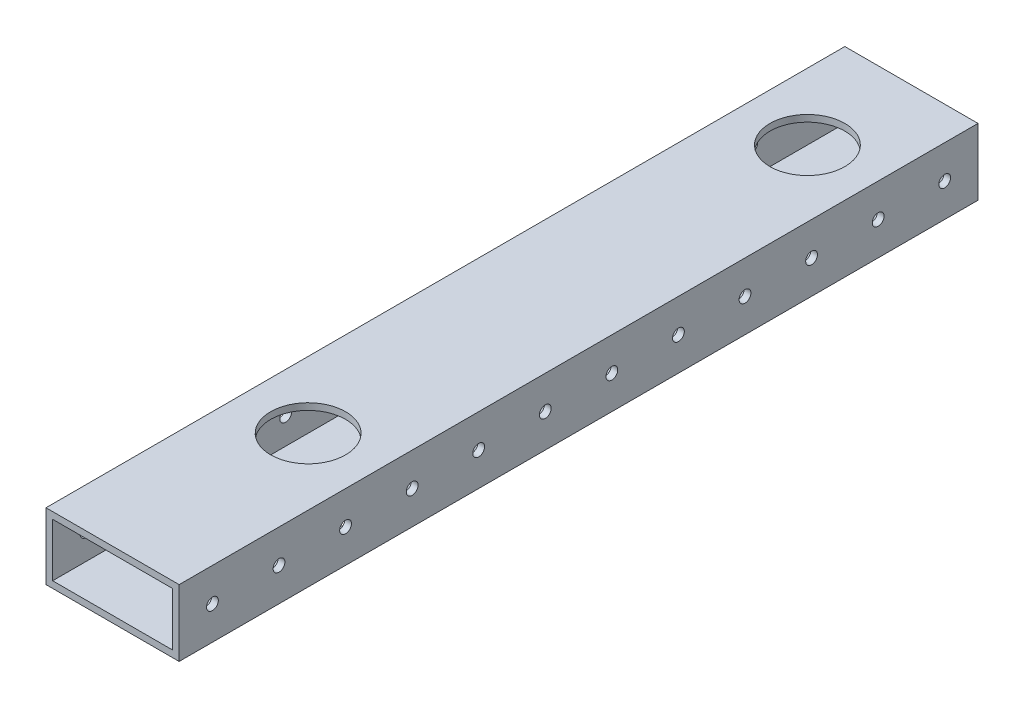
ISO-10303-21;
HEADER;
FILE_DESCRIPTION(('STEP AP214'),'2;1');
FILE_NAME('part.step','',(''),(''),'','','');
FILE_SCHEMA(('AUTOMOTIVE_DESIGN { 1 0 10303 214 1 1 1 1 }'));
ENDSEC;
DATA;
#1=APPLICATION_CONTEXT('core data for automotive mechanical design processes');
#2=APPLICATION_PROTOCOL_DEFINITION('international standard','automotive_design',2000,#1);
#3=PRODUCT_CONTEXT('',#1,'mechanical');
#4=PRODUCT('Part','Part','',(#3));
#5=PRODUCT_RELATED_PRODUCT_CATEGORY('part','',(#4));
#6=PRODUCT_DEFINITION_FORMATION('','',#4);
#7=PRODUCT_DEFINITION_CONTEXT('part definition',#1,'design');
#8=PRODUCT_DEFINITION('design','',#6,#7);
#9=PRODUCT_DEFINITION_SHAPE('','',#8);
#10=(LENGTH_UNIT() NAMED_UNIT(*) SI_UNIT(.MILLI.,.METRE.));
#11=(NAMED_UNIT(*) PLANE_ANGLE_UNIT() SI_UNIT($,.RADIAN.));
#12=(NAMED_UNIT(*) SI_UNIT($,.STERADIAN.) SOLID_ANGLE_UNIT());
#13=UNCERTAINTY_MEASURE_WITH_UNIT(LENGTH_MEASURE(1.E-05),#10,'distance_accuracy_value','');
#14=(GEOMETRIC_REPRESENTATION_CONTEXT(3) GLOBAL_UNCERTAINTY_ASSIGNED_CONTEXT((#13)) GLOBAL_UNIT_ASSIGNED_CONTEXT((#10,
#11,#12)) REPRESENTATION_CONTEXT('',''));
#15=CARTESIAN_POINT('',(0.,0.,0.));
#16=DIRECTION('',(0.,0.,1.));
#17=DIRECTION('',(1.,0.,0.));
#18=AXIS2_PLACEMENT_3D('',#15,#16,#17);
#19=CARTESIAN_POINT('',(-25.4,-12.7,-533.4));
#20=DIRECTION('',(-1.,0.,0.));
#21=DIRECTION('',(0.,0.,1.));
#22=AXIS2_PLACEMENT_3D('',#19,#20,#21);
#23=PLANE('',#22);
#24=DIRECTION('',(0.,-1.,0.));
#25=VECTOR('',#24,1.);
#26=CARTESIAN_POINT('',(-25.4,-12.7,-228.6));
#27=LINE('',#26,#25);
#28=CARTESIAN_POINT('',(-25.4,12.7,-228.6));
#29=VERTEX_POINT('',#28);
#30=CARTESIAN_POINT('',(-25.4,-12.7,-228.6));
#31=VERTEX_POINT('',#30);
#32=EDGE_CURVE('E105',#29,#31,#27,.T.);
#33=ORIENTED_EDGE('',*,*,#32,.F.);
#34=DIRECTION('',(0.,0.,1.));
#35=VECTOR('',#34,1.);
#36=CARTESIAN_POINT('',(-25.4,12.7,-533.4));
#37=LINE('',#36,#35);
#38=CARTESIAN_POINT('',(-25.4,12.7,-533.4));
#39=VERTEX_POINT('',#38);
#40=EDGE_CURVE('E117',#39,#29,#37,.T.);
#41=ORIENTED_EDGE('',*,*,#40,.F.);
#42=DIRECTION('',(0.,-1.,0.));
#43=VECTOR('',#42,1.);
#44=CARTESIAN_POINT('',(-25.4,-12.7,-533.4));
#45=LINE('',#44,#43);
#46=CARTESIAN_POINT('',(-25.4,-12.7,-533.4));
#47=VERTEX_POINT('',#46);
#48=EDGE_CURVE('E411',#39,#47,#45,.T.);
#49=ORIENTED_EDGE('',*,*,#48,.T.);
#50=DIRECTION('',(0.,0.,1.));
#51=VECTOR('',#50,1.);
#52=CARTESIAN_POINT('',(-25.4,-12.7,-533.4));
#53=LINE('',#52,#51);
#54=EDGE_CURVE('E119',#47,#31,#53,.T.);
#55=ORIENTED_EDGE('',*,*,#54,.T.);
#56=EDGE_LOOP('',(#33,#41,#49,#55));
#57=FACE_BOUND('',#56,.T.);
#58=CARTESIAN_POINT('',(-25.4,0.,-241.3));
#59=DIRECTION('',(1.,0.,0.));
#60=DIRECTION('',(0.,0.,-1.));
#61=AXIS2_PLACEMENT_3D('',#58,#59,#60);
#62=CIRCLE('',#61,2.24789999999999);
#63=CARTESIAN_POINT('',(-25.4,0.,-243.5479));
#64=VERTEX_POINT('',#63);
#65=EDGE_CURVE('E201',#64,#64,#62,.T.);
#66=ORIENTED_EDGE('',*,*,#65,.T.);
#67=EDGE_LOOP('',(#66));
#68=FACE_BOUND('',#67,.T.);
#69=CARTESIAN_POINT('',(-25.4,0.,-266.7));
#70=DIRECTION('',(1.,0.,0.));
#71=DIRECTION('',(0.,0.,-1.));
#72=AXIS2_PLACEMENT_3D('',#69,#70,#71);
#73=CIRCLE('',#72,2.24789999999999);
#74=CARTESIAN_POINT('',(-25.4,0.,-268.9479));
#75=VERTEX_POINT('',#74);
#76=EDGE_CURVE('E196',#75,#75,#73,.T.);
#77=ORIENTED_EDGE('',*,*,#76,.T.);
#78=EDGE_LOOP('',(#77));
#79=FACE_BOUND('',#78,.T.);
#80=CARTESIAN_POINT('',(-25.4,0.,-292.1));
#81=DIRECTION('',(1.,0.,0.));
#82=DIRECTION('',(0.,0.,-1.));
#83=AXIS2_PLACEMENT_3D('',#80,#81,#82);
#84=CIRCLE('',#83,2.24789999999999);
#85=CARTESIAN_POINT('',(-25.4,0.,-294.3479));
#86=VERTEX_POINT('',#85);
#87=EDGE_CURVE('E190',#86,#86,#84,.T.);
#88=ORIENTED_EDGE('',*,*,#87,.T.);
#89=EDGE_LOOP('',(#88));
#90=FACE_BOUND('',#89,.T.);
#91=CARTESIAN_POINT('',(-25.4,0.,-317.5));
#92=DIRECTION('',(1.,0.,0.));
#93=DIRECTION('',(0.,0.,-1.));
#94=AXIS2_PLACEMENT_3D('',#91,#92,#93);
#95=CIRCLE('',#94,2.24789999999999);
#96=CARTESIAN_POINT('',(-25.4,0.,-319.7479));
#97=VERTEX_POINT('',#96);
#98=EDGE_CURVE('E184',#97,#97,#95,.T.);
#99=ORIENTED_EDGE('',*,*,#98,.T.);
#100=EDGE_LOOP('',(#99));
#101=FACE_BOUND('',#100,.T.);
#102=CARTESIAN_POINT('',(-25.4,0.,-342.9));
#103=DIRECTION('',(1.,0.,0.));
#104=DIRECTION('',(0.,0.,-1.));
#105=AXIS2_PLACEMENT_3D('',#102,#103,#104);
#106=CIRCLE('',#105,2.24789999999999);
#107=CARTESIAN_POINT('',(-25.4,0.,-345.1479));
#108=VERTEX_POINT('',#107);
#109=EDGE_CURVE('E178',#108,#108,#106,.T.);
#110=ORIENTED_EDGE('',*,*,#109,.T.);
#111=EDGE_LOOP('',(#110));
#112=FACE_BOUND('',#111,.T.);
#113=CARTESIAN_POINT('',(-25.4,0.,-368.3));
#114=DIRECTION('',(1.,0.,0.));
#115=DIRECTION('',(0.,0.,-1.));
#116=AXIS2_PLACEMENT_3D('',#113,#114,#115);
#117=CIRCLE('',#116,2.24789999999999);
#118=CARTESIAN_POINT('',(-25.4,0.,-370.5479));
#119=VERTEX_POINT('',#118);
#120=EDGE_CURVE('E172',#119,#119,#117,.T.);
#121=ORIENTED_EDGE('',*,*,#120,.T.);
#122=EDGE_LOOP('',(#121));
#123=FACE_BOUND('',#122,.T.);
#124=CARTESIAN_POINT('',(-25.4,0.,-393.7));
#125=DIRECTION('',(1.,0.,0.));
#126=DIRECTION('',(0.,0.,-1.));
#127=AXIS2_PLACEMENT_3D('',#124,#125,#126);
#128=CIRCLE('',#127,2.24789999999999);
#129=CARTESIAN_POINT('',(-25.4,0.,-395.9479));
#130=VERTEX_POINT('',#129);
#131=EDGE_CURVE('E166',#130,#130,#128,.T.);
#132=ORIENTED_EDGE('',*,*,#131,.T.);
#133=EDGE_LOOP('',(#132));
#134=FACE_BOUND('',#133,.T.);
#135=CARTESIAN_POINT('',(-25.4,0.,-419.1));
#136=DIRECTION('',(1.,0.,0.));
#137=DIRECTION('',(0.,0.,-1.));
#138=AXIS2_PLACEMENT_3D('',#135,#136,#137);
#139=CIRCLE('',#138,2.24789999999999);
#140=CARTESIAN_POINT('',(-25.4,0.,-421.3479));
#141=VERTEX_POINT('',#140);
#142=EDGE_CURVE('E160',#141,#141,#139,.T.);
#143=ORIENTED_EDGE('',*,*,#142,.T.);
#144=EDGE_LOOP('',(#143));
#145=FACE_BOUND('',#144,.T.);
#146=CARTESIAN_POINT('',(-25.4,0.,-444.5));
#147=DIRECTION('',(1.,0.,0.));
#148=DIRECTION('',(0.,0.,-1.));
#149=AXIS2_PLACEMENT_3D('',#146,#147,#148);
#150=CIRCLE('',#149,2.24789999999999);
#151=CARTESIAN_POINT('',(-25.4,0.,-446.7479));
#152=VERTEX_POINT('',#151);
#153=EDGE_CURVE('E154',#152,#152,#150,.T.);
#154=ORIENTED_EDGE('',*,*,#153,.T.);
#155=EDGE_LOOP('',(#154));
#156=FACE_BOUND('',#155,.T.);
#157=CARTESIAN_POINT('',(-25.4,0.,-469.9));
#158=DIRECTION('',(1.,0.,0.));
#159=DIRECTION('',(0.,0.,-1.));
#160=AXIS2_PLACEMENT_3D('',#157,#158,#159);
#161=CIRCLE('',#160,2.24789999999999);
#162=CARTESIAN_POINT('',(-25.4,0.,-472.1479));
#163=VERTEX_POINT('',#162);
#164=EDGE_CURVE('E148',#163,#163,#161,.T.);
#165=ORIENTED_EDGE('',*,*,#164,.T.);
#166=EDGE_LOOP('',(#165));
#167=FACE_BOUND('',#166,.T.);
#168=CARTESIAN_POINT('',(-25.4,0.,-495.3));
#169=DIRECTION('',(1.,0.,0.));
#170=DIRECTION('',(0.,0.,-1.));
#171=AXIS2_PLACEMENT_3D('',#168,#169,#170);
#172=CIRCLE('',#171,2.24789999999999);
#173=CARTESIAN_POINT('',(-25.4,0.,-497.5479));
#174=VERTEX_POINT('',#173);
#175=EDGE_CURVE('E142',#174,#174,#172,.T.);
#176=ORIENTED_EDGE('',*,*,#175,.T.);
#177=EDGE_LOOP('',(#176));
#178=FACE_BOUND('',#177,.T.);
#179=CARTESIAN_POINT('',(-25.4,0.,-520.7));
#180=DIRECTION('',(1.,0.,0.));
#181=DIRECTION('',(0.,0.,-1.));
#182=AXIS2_PLACEMENT_3D('',#179,#180,#181);
#183=CIRCLE('',#182,2.24789999999999);
#184=CARTESIAN_POINT('',(-25.4,0.,-522.9479));
#185=VERTEX_POINT('',#184);
#186=EDGE_CURVE('E361',#185,#185,#183,.T.);
#187=ORIENTED_EDGE('',*,*,#186,.T.);
#188=EDGE_LOOP('',(#187));
#189=FACE_BOUND('',#188,.T.);
#190=ADVANCED_FACE('F38',(#57,#68,#79,#90,#101,#112,#123,#134,#145,#156,#167,#178,#189),#23,.T.);
#191=CARTESIAN_POINT('',(25.4,-12.7,-533.4));
#192=DIRECTION('',(1.,0.,0.));
#193=DIRECTION('',(0.,0.,-1.));
#194=AXIS2_PLACEMENT_3D('',#191,#192,#193);
#195=PLANE('',#194);
#196=DIRECTION('',(0.,1.,0.));
#197=VECTOR('',#196,1.);
#198=CARTESIAN_POINT('',(25.4,-12.7,-228.6));
#199=LINE('',#198,#197);
#200=CARTESIAN_POINT('',(25.4,-12.7,-228.6));
#201=VERTEX_POINT('',#200);
#202=CARTESIAN_POINT('',(25.4,12.7,-228.6));
#203=VERTEX_POINT('',#202);
#204=EDGE_CURVE('E56',#201,#203,#199,.T.);
#205=ORIENTED_EDGE('',*,*,#204,.F.);
#206=DIRECTION('',(0.,0.,1.));
#207=VECTOR('',#206,1.);
#208=CARTESIAN_POINT('',(25.4,-12.7,-533.4));
#209=LINE('',#208,#207);
#210=CARTESIAN_POINT('',(25.4,-12.7,-533.4));
#211=VERTEX_POINT('',#210);
#212=EDGE_CURVE('E48',#211,#201,#209,.T.);
#213=ORIENTED_EDGE('',*,*,#212,.F.);
#214=DIRECTION('',(0.,1.,0.));
#215=VECTOR('',#214,1.);
#216=CARTESIAN_POINT('',(25.4,-12.7,-533.4));
#217=LINE('',#216,#215);
#218=CARTESIAN_POINT('',(25.4,12.7,-533.4));
#219=VERTEX_POINT('',#218);
#220=EDGE_CURVE('E394',#211,#219,#217,.T.);
#221=ORIENTED_EDGE('',*,*,#220,.T.);
#222=DIRECTION('',(0.,0.,1.));
#223=VECTOR('',#222,1.);
#224=CARTESIAN_POINT('',(25.4,12.7,-533.4));
#225=LINE('',#224,#223);
#226=EDGE_CURVE('E128',#219,#203,#225,.T.);
#227=ORIENTED_EDGE('',*,*,#226,.T.);
#228=EDGE_LOOP('',(#205,#213,#221,#227));
#229=FACE_BOUND('',#228,.T.);
#230=CARTESIAN_POINT('',(25.4,0.,-241.3));
#231=DIRECTION('',(1.,0.,0.));
#232=DIRECTION('',(0.,0.,-1.));
#233=AXIS2_PLACEMENT_3D('',#230,#231,#232);
#234=CIRCLE('',#233,2.24789999999999);
#235=CARTESIAN_POINT('',(25.4,0.,-243.5479));
#236=VERTEX_POINT('',#235);
#237=EDGE_CURVE('E121',#236,#236,#234,.T.);
#238=ORIENTED_EDGE('',*,*,#237,.F.);
#239=EDGE_LOOP('',(#238));
#240=FACE_BOUND('',#239,.T.);
#241=CARTESIAN_POINT('',(25.4,0.,-266.7));
#242=DIRECTION('',(1.,0.,0.));
#243=DIRECTION('',(0.,0.,-1.));
#244=AXIS2_PLACEMENT_3D('',#241,#242,#243);
#245=CIRCLE('',#244,2.24789999999999);
#246=CARTESIAN_POINT('',(25.4,0.,-268.9479));
#247=VERTEX_POINT('',#246);
#248=EDGE_CURVE('E257',#247,#247,#245,.T.);
#249=ORIENTED_EDGE('',*,*,#248,.F.);
#250=EDGE_LOOP('',(#249));
#251=FACE_BOUND('',#250,.T.);
#252=CARTESIAN_POINT('',(25.4,0.,-292.1));
#253=DIRECTION('',(1.,0.,0.));
#254=DIRECTION('',(0.,0.,-1.));
#255=AXIS2_PLACEMENT_3D('',#252,#253,#254);
#256=CIRCLE('',#255,2.24789999999999);
#257=CARTESIAN_POINT('',(25.4,0.,-294.3479));
#258=VERTEX_POINT('',#257);
#259=EDGE_CURVE('E267',#258,#258,#256,.T.);
#260=ORIENTED_EDGE('',*,*,#259,.F.);
#261=EDGE_LOOP('',(#260));
#262=FACE_BOUND('',#261,.T.);
#263=CARTESIAN_POINT('',(25.4,0.,-317.5));
#264=DIRECTION('',(1.,0.,0.));
#265=DIRECTION('',(0.,0.,-1.));
#266=AXIS2_PLACEMENT_3D('',#263,#264,#265);
#267=CIRCLE('',#266,2.24789999999999);
#268=CARTESIAN_POINT('',(25.4,0.,-319.7479));
#269=VERTEX_POINT('',#268);
#270=EDGE_CURVE('E277',#269,#269,#267,.T.);
#271=ORIENTED_EDGE('',*,*,#270,.F.);
#272=EDGE_LOOP('',(#271));
#273=FACE_BOUND('',#272,.T.);
#274=CARTESIAN_POINT('',(25.4,0.,-342.9));
#275=DIRECTION('',(1.,0.,0.));
#276=DIRECTION('',(0.,0.,-1.));
#277=AXIS2_PLACEMENT_3D('',#274,#275,#276);
#278=CIRCLE('',#277,2.24789999999999);
#279=CARTESIAN_POINT('',(25.4,0.,-345.1479));
#280=VERTEX_POINT('',#279);
#281=EDGE_CURVE('E287',#280,#280,#278,.T.);
#282=ORIENTED_EDGE('',*,*,#281,.F.);
#283=EDGE_LOOP('',(#282));
#284=FACE_BOUND('',#283,.T.);
#285=CARTESIAN_POINT('',(25.4,0.,-368.3));
#286=DIRECTION('',(1.,0.,0.));
#287=DIRECTION('',(0.,0.,-1.));
#288=AXIS2_PLACEMENT_3D('',#285,#286,#287);
#289=CIRCLE('',#288,2.24789999999999);
#290=CARTESIAN_POINT('',(25.4,0.,-370.5479));
#291=VERTEX_POINT('',#290);
#292=EDGE_CURVE('E297',#291,#291,#289,.T.);
#293=ORIENTED_EDGE('',*,*,#292,.F.);
#294=EDGE_LOOP('',(#293));
#295=FACE_BOUND('',#294,.T.);
#296=CARTESIAN_POINT('',(25.4,0.,-393.7));
#297=DIRECTION('',(1.,0.,0.));
#298=DIRECTION('',(0.,0.,-1.));
#299=AXIS2_PLACEMENT_3D('',#296,#297,#298);
#300=CIRCLE('',#299,2.24789999999999);
#301=CARTESIAN_POINT('',(25.4,0.,-395.9479));
#302=VERTEX_POINT('',#301);
#303=EDGE_CURVE('E307',#302,#302,#300,.T.);
#304=ORIENTED_EDGE('',*,*,#303,.F.);
#305=EDGE_LOOP('',(#304));
#306=FACE_BOUND('',#305,.T.);
#307=CARTESIAN_POINT('',(25.4,0.,-419.1));
#308=DIRECTION('',(1.,0.,0.));
#309=DIRECTION('',(0.,0.,-1.));
#310=AXIS2_PLACEMENT_3D('',#307,#308,#309);
#311=CIRCLE('',#310,2.24789999999999);
#312=CARTESIAN_POINT('',(25.4,0.,-421.3479));
#313=VERTEX_POINT('',#312);
#314=EDGE_CURVE('E317',#313,#313,#311,.T.);
#315=ORIENTED_EDGE('',*,*,#314,.F.);
#316=EDGE_LOOP('',(#315));
#317=FACE_BOUND('',#316,.T.);
#318=CARTESIAN_POINT('',(25.4,0.,-444.5));
#319=DIRECTION('',(1.,0.,0.));
#320=DIRECTION('',(0.,0.,-1.));
#321=AXIS2_PLACEMENT_3D('',#318,#319,#320);
#322=CIRCLE('',#321,2.24789999999999);
#323=CARTESIAN_POINT('',(25.4,0.,-446.7479));
#324=VERTEX_POINT('',#323);
#325=EDGE_CURVE('E327',#324,#324,#322,.T.);
#326=ORIENTED_EDGE('',*,*,#325,.F.);
#327=EDGE_LOOP('',(#326));
#328=FACE_BOUND('',#327,.T.);
#329=CARTESIAN_POINT('',(25.4,0.,-469.9));
#330=DIRECTION('',(1.,0.,0.));
#331=DIRECTION('',(0.,0.,-1.));
#332=AXIS2_PLACEMENT_3D('',#329,#330,#331);
#333=CIRCLE('',#332,2.24789999999999);
#334=CARTESIAN_POINT('',(25.4,0.,-472.1479));
#335=VERTEX_POINT('',#334);
#336=EDGE_CURVE('E337',#335,#335,#333,.T.);
#337=ORIENTED_EDGE('',*,*,#336,.F.);
#338=EDGE_LOOP('',(#337));
#339=FACE_BOUND('',#338,.T.);
#340=CARTESIAN_POINT('',(25.4,0.,-495.3));
#341=DIRECTION('',(1.,0.,0.));
#342=DIRECTION('',(0.,0.,-1.));
#343=AXIS2_PLACEMENT_3D('',#340,#341,#342);
#344=CIRCLE('',#343,2.24789999999999);
#345=CARTESIAN_POINT('',(25.4,0.,-497.5479));
#346=VERTEX_POINT('',#345);
#347=EDGE_CURVE('E347',#346,#346,#344,.T.);
#348=ORIENTED_EDGE('',*,*,#347,.F.);
#349=EDGE_LOOP('',(#348));
#350=FACE_BOUND('',#349,.T.);
#351=CARTESIAN_POINT('',(25.4,0.,-520.7));
#352=DIRECTION('',(1.,0.,0.));
#353=DIRECTION('',(0.,0.,-1.));
#354=AXIS2_PLACEMENT_3D('',#351,#352,#353);
#355=CIRCLE('',#354,2.24789999999999);
#356=CARTESIAN_POINT('',(25.4,0.,-522.9479));
#357=VERTEX_POINT('',#356);
#358=EDGE_CURVE('E357',#357,#357,#355,.T.);
#359=ORIENTED_EDGE('',*,*,#358,.F.);
#360=EDGE_LOOP('',(#359));
#361=FACE_BOUND('',#360,.T.);
#362=ADVANCED_FACE('F40',(#229,#240,#251,#262,#273,#284,#295,#306,#317,#328,#339,#350,#361),
#195,.T.);
#363=CARTESIAN_POINT('',(-25.4,-12.7,-533.4));
#364=DIRECTION('',(0.,-1.,0.));
#365=DIRECTION('',(0.,0.,-1.));
#366=AXIS2_PLACEMENT_3D('',#363,#364,#365);
#367=PLANE('',#366);
#368=CARTESIAN_POINT('',(0.,-12.7,-493.7125));
#369=DIRECTION('',(0.,-1.,0.));
#370=DIRECTION('',(0.,0.,-1.));
#371=AXIS2_PLACEMENT_3D('',#368,#369,#370);
#372=CIRCLE('',#371,14.2875);
#373=CARTESIAN_POINT('',(0.,-12.7,-508.));
#374=VERTEX_POINT('',#373);
#375=EDGE_CURVE('E111',#374,#374,#372,.T.);
#376=ORIENTED_EDGE('',*,*,#375,.F.);
#377=EDGE_LOOP('',(#376));
#378=FACE_BOUND('',#377,.T.);
#379=CARTESIAN_POINT('',(0.,-12.7,-303.2125));
#380=DIRECTION('',(0.,-1.,0.));
#381=DIRECTION('',(0.,0.,-1.));
#382=AXIS2_PLACEMENT_3D('',#379,#380,#381);
#383=CIRCLE('',#382,14.2875);
#384=CARTESIAN_POINT('',(0.,-12.7,-317.5));
#385=VERTEX_POINT('',#384);
#386=EDGE_CURVE('E212',#385,#385,#383,.T.);
#387=ORIENTED_EDGE('',*,*,#386,.F.);
#388=EDGE_LOOP('',(#387));
#389=FACE_BOUND('',#388,.T.);
#390=DIRECTION('',(1.,0.,0.));
#391=VECTOR('',#390,1.);
#392=CARTESIAN_POINT('',(-25.4,-12.7,-228.6));
#393=LINE('',#392,#391);
#394=EDGE_CURVE('E243',#31,#201,#393,.T.);
#395=ORIENTED_EDGE('',*,*,#394,.F.);
#396=ORIENTED_EDGE('',*,*,#54,.F.);
#397=DIRECTION('',(1.,0.,0.));
#398=VECTOR('',#397,1.);
#399=CARTESIAN_POINT('',(-25.4,-12.7,-533.4));
#400=LINE('',#399,#398);
#401=EDGE_CURVE('E133',#47,#211,#400,.T.);
#402=ORIENTED_EDGE('',*,*,#401,.T.);
#403=ORIENTED_EDGE('',*,*,#212,.T.);
#404=EDGE_LOOP('',(#395,#396,#402,#403));
#405=FACE_BOUND('',#404,.T.);
#406=ADVANCED_FACE('F419',(#378,#389,#405),#367,.T.);
#407=CARTESIAN_POINT('',(-25.4,12.7,-533.4));
#408=DIRECTION('',(0.,1.,0.));
#409=DIRECTION('',(0.,0.,1.));
#410=AXIS2_PLACEMENT_3D('',#407,#408,#409);
#411=PLANE('',#410);
#412=CARTESIAN_POINT('',(0.,12.7,-493.7125));
#413=DIRECTION('',(0.,1.,0.));
#414=DIRECTION('',(0.,0.,1.));
#415=AXIS2_PLACEMENT_3D('',#412,#413,#414);
#416=CIRCLE('',#415,14.2875);
#417=CARTESIAN_POINT('',(0.,12.7,-479.425));
#418=VERTEX_POINT('',#417);
#419=EDGE_CURVE('E206',#418,#418,#416,.T.);
#420=ORIENTED_EDGE('',*,*,#419,.F.);
#421=EDGE_LOOP('',(#420));
#422=FACE_BOUND('',#421,.T.);
#423=CARTESIAN_POINT('',(0.,12.7,-303.2125));
#424=DIRECTION('',(0.,1.,0.));
#425=DIRECTION('',(0.,0.,1.));
#426=AXIS2_PLACEMENT_3D('',#423,#424,#425);
#427=CIRCLE('',#426,14.2875);
#428=CARTESIAN_POINT('',(0.,12.7,-288.925));
#429=VERTEX_POINT('',#428);
#430=EDGE_CURVE('E215',#429,#429,#427,.T.);
#431=ORIENTED_EDGE('',*,*,#430,.F.);
#432=EDGE_LOOP('',(#431));
#433=FACE_BOUND('',#432,.T.);
#434=DIRECTION('',(-1.,0.,0.));
#435=VECTOR('',#434,1.);
#436=CARTESIAN_POINT('',(-94.0568861231913,12.7,-228.6));
#437=LINE('',#436,#435);
#438=EDGE_CURVE('E102',#203,#29,#437,.T.);
#439=ORIENTED_EDGE('',*,*,#438,.F.);
#440=ORIENTED_EDGE('',*,*,#226,.F.);
#441=DIRECTION('',(-1.,0.,0.));
#442=VECTOR('',#441,1.);
#443=CARTESIAN_POINT('',(-25.4,12.7,-533.4));
#444=LINE('',#443,#442);
#445=EDGE_CURVE('E126',#219,#39,#444,.T.);
#446=ORIENTED_EDGE('',*,*,#445,.T.);
#447=ORIENTED_EDGE('',*,*,#40,.T.);
#448=EDGE_LOOP('',(#439,#440,#446,#447));
#449=FACE_BOUND('',#448,.T.);
#450=ADVANCED_FACE('F124',(#422,#433,#449),#411,.T.);
#451=CARTESIAN_POINT('',(0.,0.,-533.4));
#452=DIRECTION('',(0.,0.,-1.));
#453=DIRECTION('',(-1.,0.,0.));
#454=AXIS2_PLACEMENT_3D('',#451,#452,#453);
#455=PLANE('',#454);
#456=DIRECTION('',(0.,1.,0.));
#457=VECTOR('',#456,1.);
#458=CARTESIAN_POINT('',(22.86,-10.16,-533.4));
#459=LINE('',#458,#457);
#460=CARTESIAN_POINT('',(22.86,-10.16,-533.4));
#461=VERTEX_POINT('',#460);
#462=CARTESIAN_POINT('',(22.86,10.16,-533.4));
#463=VERTEX_POINT('',#462);
#464=EDGE_CURVE('E373',#461,#463,#459,.T.);
#465=ORIENTED_EDGE('',*,*,#464,.T.);
#466=DIRECTION('',(-1.,0.,0.));
#467=VECTOR('',#466,1.);
#468=CARTESIAN_POINT('',(-22.86,10.16,-533.4));
#469=LINE('',#468,#467);
#470=CARTESIAN_POINT('',(-22.86,10.16,-533.4));
#471=VERTEX_POINT('',#470);
#472=EDGE_CURVE('E377',#463,#471,#469,.T.);
#473=ORIENTED_EDGE('',*,*,#472,.T.);
#474=DIRECTION('',(0.,-1.,0.));
#475=VECTOR('',#474,1.);
#476=CARTESIAN_POINT('',(-22.86,-10.16,-533.4));
#477=LINE('',#476,#475);
#478=CARTESIAN_POINT('',(-22.86,-10.16,-533.4));
#479=VERTEX_POINT('',#478);
#480=EDGE_CURVE('E381',#471,#479,#477,.T.);
#481=ORIENTED_EDGE('',*,*,#480,.T.);
#482=DIRECTION('',(1.,0.,0.));
#483=VECTOR('',#482,1.);
#484=CARTESIAN_POINT('',(-22.86,-10.16,-533.4));
#485=LINE('',#484,#483);
#486=EDGE_CURVE('E385',#479,#461,#485,.T.);
#487=ORIENTED_EDGE('',*,*,#486,.T.);
#488=EDGE_LOOP('',(#465,#473,#481,#487));
#489=FACE_BOUND('',#488,.T.);
#490=ORIENTED_EDGE('',*,*,#220,.F.);
#491=ORIENTED_EDGE('',*,*,#401,.F.);
#492=ORIENTED_EDGE('',*,*,#48,.F.);
#493=ORIENTED_EDGE('',*,*,#445,.F.);
#494=EDGE_LOOP('',(#490,#491,#492,#493));
#495=FACE_BOUND('',#494,.T.);
#496=ADVANCED_FACE('F425',(#489,#495),#455,.T.);
#497=CARTESIAN_POINT('',(22.86,-10.16,-533.4));
#498=DIRECTION('',(1.,0.,0.));
#499=DIRECTION('',(0.,0.,-1.));
#500=AXIS2_PLACEMENT_3D('',#497,#498,#499);
#501=PLANE('',#500);
#502=CARTESIAN_POINT('',(22.86,0.,-241.3));
#503=DIRECTION('',(1.,0.,0.));
#504=DIRECTION('',(0.,0.,-1.));
#505=AXIS2_PLACEMENT_3D('',#502,#503,#504);
#506=CIRCLE('',#505,2.24789999999999);
#507=CARTESIAN_POINT('',(22.86,0.,-243.5479));
#508=VERTEX_POINT('',#507);
#509=EDGE_CURVE('E200',#508,#508,#506,.T.);
#510=ORIENTED_EDGE('',*,*,#509,.T.);
#511=EDGE_LOOP('',(#510));
#512=FACE_BOUND('',#511,.T.);
#513=CARTESIAN_POINT('',(22.86,0.,-266.7));
#514=DIRECTION('',(1.,0.,0.));
#515=DIRECTION('',(0.,0.,-1.));
#516=AXIS2_PLACEMENT_3D('',#513,#514,#515);
#517=CIRCLE('',#516,2.24789999999999);
#518=CARTESIAN_POINT('',(22.86,0.,-268.9479));
#519=VERTEX_POINT('',#518);
#520=EDGE_CURVE('E195',#519,#519,#517,.T.);
#521=ORIENTED_EDGE('',*,*,#520,.T.);
#522=EDGE_LOOP('',(#521));
#523=FACE_BOUND('',#522,.T.);
#524=CARTESIAN_POINT('',(22.86,0.,-292.1));
#525=DIRECTION('',(1.,0.,0.));
#526=DIRECTION('',(0.,0.,-1.));
#527=AXIS2_PLACEMENT_3D('',#524,#525,#526);
#528=CIRCLE('',#527,2.24789999999999);
#529=CARTESIAN_POINT('',(22.86,0.,-294.3479));
#530=VERTEX_POINT('',#529);
#531=EDGE_CURVE('E189',#530,#530,#528,.T.);
#532=ORIENTED_EDGE('',*,*,#531,.T.);
#533=EDGE_LOOP('',(#532));
#534=FACE_BOUND('',#533,.T.);
#535=CARTESIAN_POINT('',(22.86,0.,-317.5));
#536=DIRECTION('',(1.,0.,0.));
#537=DIRECTION('',(0.,0.,-1.));
#538=AXIS2_PLACEMENT_3D('',#535,#536,#537);
#539=CIRCLE('',#538,2.24789999999999);
#540=CARTESIAN_POINT('',(22.86,0.,-319.7479));
#541=VERTEX_POINT('',#540);
#542=EDGE_CURVE('E183',#541,#541,#539,.T.);
#543=ORIENTED_EDGE('',*,*,#542,.T.);
#544=EDGE_LOOP('',(#543));
#545=FACE_BOUND('',#544,.T.);
#546=CARTESIAN_POINT('',(22.86,0.,-342.9));
#547=DIRECTION('',(1.,0.,0.));
#548=DIRECTION('',(0.,0.,-1.));
#549=AXIS2_PLACEMENT_3D('',#546,#547,#548);
#550=CIRCLE('',#549,2.24789999999999);
#551=CARTESIAN_POINT('',(22.86,0.,-345.1479));
#552=VERTEX_POINT('',#551);
#553=EDGE_CURVE('E177',#552,#552,#550,.T.);
#554=ORIENTED_EDGE('',*,*,#553,.T.);
#555=EDGE_LOOP('',(#554));
#556=FACE_BOUND('',#555,.T.);
#557=CARTESIAN_POINT('',(22.86,0.,-368.3));
#558=DIRECTION('',(1.,0.,0.));
#559=DIRECTION('',(0.,0.,-1.));
#560=AXIS2_PLACEMENT_3D('',#557,#558,#559);
#561=CIRCLE('',#560,2.24789999999999);
#562=CARTESIAN_POINT('',(22.86,0.,-370.5479));
#563=VERTEX_POINT('',#562);
#564=EDGE_CURVE('E171',#563,#563,#561,.T.);
#565=ORIENTED_EDGE('',*,*,#564,.T.);
#566=EDGE_LOOP('',(#565));
#567=FACE_BOUND('',#566,.T.);
#568=CARTESIAN_POINT('',(22.86,0.,-393.7));
#569=DIRECTION('',(1.,0.,0.));
#570=DIRECTION('',(0.,0.,-1.));
#571=AXIS2_PLACEMENT_3D('',#568,#569,#570);
#572=CIRCLE('',#571,2.24789999999999);
#573=CARTESIAN_POINT('',(22.86,0.,-395.9479));
#574=VERTEX_POINT('',#573);
#575=EDGE_CURVE('E165',#574,#574,#572,.T.);
#576=ORIENTED_EDGE('',*,*,#575,.T.);
#577=EDGE_LOOP('',(#576));
#578=FACE_BOUND('',#577,.T.);
#579=CARTESIAN_POINT('',(22.86,0.,-419.1));
#580=DIRECTION('',(1.,0.,0.));
#581=DIRECTION('',(0.,0.,-1.));
#582=AXIS2_PLACEMENT_3D('',#579,#580,#581);
#583=CIRCLE('',#582,2.24789999999999);
#584=CARTESIAN_POINT('',(22.86,0.,-421.3479));
#585=VERTEX_POINT('',#584);
#586=EDGE_CURVE('E159',#585,#585,#583,.T.);
#587=ORIENTED_EDGE('',*,*,#586,.T.);
#588=EDGE_LOOP('',(#587));
#589=FACE_BOUND('',#588,.T.);
#590=CARTESIAN_POINT('',(22.86,0.,-444.5));
#591=DIRECTION('',(1.,0.,0.));
#592=DIRECTION('',(0.,0.,-1.));
#593=AXIS2_PLACEMENT_3D('',#590,#591,#592);
#594=CIRCLE('',#593,2.24789999999999);
#595=CARTESIAN_POINT('',(22.86,0.,-446.7479));
#596=VERTEX_POINT('',#595);
#597=EDGE_CURVE('E149',#596,#596,#594,.T.);
#598=ORIENTED_EDGE('',*,*,#597,.T.);
#599=EDGE_LOOP('',(#598));
#600=FACE_BOUND('',#599,.T.);
#601=CARTESIAN_POINT('',(22.86,0.,-469.9));
#602=DIRECTION('',(1.,0.,0.));
#603=DIRECTION('',(0.,0.,-1.));
#604=AXIS2_PLACEMENT_3D('',#601,#602,#603);
#605=CIRCLE('',#604,2.24789999999999);
#606=CARTESIAN_POINT('',(22.86,0.,-472.1479));
#607=VERTEX_POINT('',#606);
#608=EDGE_CURVE('E143',#607,#607,#605,.T.);
#609=ORIENTED_EDGE('',*,*,#608,.T.);
#610=EDGE_LOOP('',(#609));
#611=FACE_BOUND('',#610,.T.);
#612=CARTESIAN_POINT('',(22.86,0.,-495.3));
#613=DIRECTION('',(1.,0.,0.));
#614=DIRECTION('',(0.,0.,-1.));
#615=AXIS2_PLACEMENT_3D('',#612,#613,#614);
#616=CIRCLE('',#615,2.24789999999999);
#617=CARTESIAN_POINT('',(22.86,0.,-497.5479));
#618=VERTEX_POINT('',#617);
#619=EDGE_CURVE('E137',#618,#618,#616,.T.);
#620=ORIENTED_EDGE('',*,*,#619,.T.);
#621=EDGE_LOOP('',(#620));
#622=FACE_BOUND('',#621,.T.);
#623=CARTESIAN_POINT('',(22.86,0.,-520.7));
#624=DIRECTION('',(1.,0.,0.));
#625=DIRECTION('',(0.,0.,-1.));
#626=AXIS2_PLACEMENT_3D('',#623,#624,#625);
#627=CIRCLE('',#626,2.24789999999999);
#628=CARTESIAN_POINT('',(22.86,0.,-522.9479));
#629=VERTEX_POINT('',#628);
#630=EDGE_CURVE('E365',#629,#629,#627,.T.);
#631=ORIENTED_EDGE('',*,*,#630,.T.);
#632=EDGE_LOOP('',(#631));
#633=FACE_BOUND('',#632,.T.);
#634=DIRECTION('',(0.,0.,1.));
#635=VECTOR('',#634,1.);
#636=CARTESIAN_POINT('',(22.86,-10.16,-533.4));
#637=LINE('',#636,#635);
#638=CARTESIAN_POINT('',(22.86,-10.16,-228.6));
#639=VERTEX_POINT('',#638);
#640=EDGE_CURVE('E390',#461,#639,#637,.T.);
#641=ORIENTED_EDGE('',*,*,#640,.T.);
#642=DIRECTION('',(0.,1.,0.));
#643=VECTOR('',#642,1.);
#644=CARTESIAN_POINT('',(22.86,-10.16,-228.6));
#645=LINE('',#644,#643);
#646=CARTESIAN_POINT('',(22.86,10.16,-228.6));
#647=VERTEX_POINT('',#646);
#648=EDGE_CURVE('E239',#639,#647,#645,.T.);
#649=ORIENTED_EDGE('',*,*,#648,.T.);
#650=DIRECTION('',(0.,0.,1.));
#651=VECTOR('',#650,1.);
#652=CARTESIAN_POINT('',(22.86,10.16,-533.4));
#653=LINE('',#652,#651);
#654=EDGE_CURVE('E389',#463,#647,#653,.T.);
#655=ORIENTED_EDGE('',*,*,#654,.F.);
#656=ORIENTED_EDGE('',*,*,#464,.F.);
#657=EDGE_LOOP('',(#641,#649,#655,#656));
#658=FACE_BOUND('',#657,.T.);
#659=ADVANCED_FACE('F427',(#512,#523,#534,#545,#556,#567,#578,#589,#600,#611,#622,#633,#658),
#501,.F.);
#660=CARTESIAN_POINT('',(-22.86,-10.16,-533.4));
#661=DIRECTION('',(0.,-1.,0.));
#662=DIRECTION('',(0.,0.,-1.));
#663=AXIS2_PLACEMENT_3D('',#660,#661,#662);
#664=PLANE('',#663);
#665=CARTESIAN_POINT('',(0.,-10.16,-493.7125));
#666=DIRECTION('',(0.,-1.,0.));
#667=DIRECTION('',(0.,0.,-1.));
#668=AXIS2_PLACEMENT_3D('',#665,#666,#667);
#669=CIRCLE('',#668,14.2875);
#670=CARTESIAN_POINT('',(0.,-10.16,-508.));
#671=VERTEX_POINT('',#670);
#672=EDGE_CURVE('E226',#671,#671,#669,.T.);
#673=ORIENTED_EDGE('',*,*,#672,.T.);
#674=EDGE_LOOP('',(#673));
#675=FACE_BOUND('',#674,.T.);
#676=CARTESIAN_POINT('',(0.,-10.16,-303.2125));
#677=DIRECTION('',(0.,-1.,0.));
#678=DIRECTION('',(0.,0.,-1.));
#679=AXIS2_PLACEMENT_3D('',#676,#677,#678);
#680=CIRCLE('',#679,14.2875);
#681=CARTESIAN_POINT('',(0.,-10.16,-317.5));
#682=VERTEX_POINT('',#681);
#683=EDGE_CURVE('E205',#682,#682,#680,.T.);
#684=ORIENTED_EDGE('',*,*,#683,.T.);
#685=EDGE_LOOP('',(#684));
#686=FACE_BOUND('',#685,.T.);
#687=DIRECTION('',(0.,0.,1.));
#688=VECTOR('',#687,1.);
#689=CARTESIAN_POINT('',(-22.86,-10.16,-533.4));
#690=LINE('',#689,#688);
#691=CARTESIAN_POINT('',(-22.86,-10.16,-228.6));
#692=VERTEX_POINT('',#691);
#693=EDGE_CURVE('E395',#479,#692,#690,.T.);
#694=ORIENTED_EDGE('',*,*,#693,.T.);
#695=DIRECTION('',(1.,0.,0.));
#696=VECTOR('',#695,1.);
#697=CARTESIAN_POINT('',(-22.86,-10.16,-228.6));
#698=LINE('',#697,#696);
#699=EDGE_CURVE('E235',#692,#639,#698,.T.);
#700=ORIENTED_EDGE('',*,*,#699,.T.);
#701=ORIENTED_EDGE('',*,*,#640,.F.);
#702=ORIENTED_EDGE('',*,*,#486,.F.);
#703=EDGE_LOOP('',(#694,#700,#701,#702));
#704=FACE_BOUND('',#703,.T.);
#705=ADVANCED_FACE('F434',(#675,#686,#704),#664,.F.);
#706=CARTESIAN_POINT('',(-22.86,-10.16,-533.4));
#707=DIRECTION('',(-1.,0.,0.));
#708=DIRECTION('',(0.,0.,1.));
#709=AXIS2_PLACEMENT_3D('',#706,#707,#708);
#710=PLANE('',#709);
#711=CARTESIAN_POINT('',(-22.86,0.,-241.3));
#712=DIRECTION('',(-1.,0.,0.));
#713=DIRECTION('',(0.,0.,1.));
#714=AXIS2_PLACEMENT_3D('',#711,#712,#713);
#715=CIRCLE('',#714,2.24789999999999);
#716=CARTESIAN_POINT('',(-22.86,0.,-239.0521));
#717=VERTEX_POINT('',#716);
#718=EDGE_CURVE('E197',#717,#717,#715,.T.);
#719=ORIENTED_EDGE('',*,*,#718,.T.);
#720=EDGE_LOOP('',(#719));
#721=FACE_BOUND('',#720,.T.);
#722=CARTESIAN_POINT('',(-22.86,0.,-266.7));
#723=DIRECTION('',(-1.,0.,0.));
#724=DIRECTION('',(0.,0.,1.));
#725=AXIS2_PLACEMENT_3D('',#722,#723,#724);
#726=CIRCLE('',#725,2.24789999999999);
#727=CARTESIAN_POINT('',(-22.86,0.,-264.4521));
#728=VERTEX_POINT('',#727);
#729=EDGE_CURVE('E191',#728,#728,#726,.T.);
#730=ORIENTED_EDGE('',*,*,#729,.T.);
#731=EDGE_LOOP('',(#730));
#732=FACE_BOUND('',#731,.T.);
#733=CARTESIAN_POINT('',(-22.86,0.,-292.1));
#734=DIRECTION('',(-1.,0.,0.));
#735=DIRECTION('',(0.,0.,1.));
#736=AXIS2_PLACEMENT_3D('',#733,#734,#735);
#737=CIRCLE('',#736,2.24789999999999);
#738=CARTESIAN_POINT('',(-22.86,0.,-289.8521));
#739=VERTEX_POINT('',#738);
#740=EDGE_CURVE('E185',#739,#739,#737,.T.);
#741=ORIENTED_EDGE('',*,*,#740,.T.);
#742=EDGE_LOOP('',(#741));
#743=FACE_BOUND('',#742,.T.);
#744=CARTESIAN_POINT('',(-22.86,0.,-317.5));
#745=DIRECTION('',(-1.,0.,0.));
#746=DIRECTION('',(0.,0.,1.));
#747=AXIS2_PLACEMENT_3D('',#744,#745,#746);
#748=CIRCLE('',#747,2.24789999999999);
#749=CARTESIAN_POINT('',(-22.86,0.,-315.2521));
#750=VERTEX_POINT('',#749);
#751=EDGE_CURVE('E179',#750,#750,#748,.T.);
#752=ORIENTED_EDGE('',*,*,#751,.T.);
#753=EDGE_LOOP('',(#752));
#754=FACE_BOUND('',#753,.T.);
#755=CARTESIAN_POINT('',(-22.86,0.,-342.9));
#756=DIRECTION('',(-1.,0.,0.));
#757=DIRECTION('',(0.,0.,1.));
#758=AXIS2_PLACEMENT_3D('',#755,#756,#757);
#759=CIRCLE('',#758,2.24789999999999);
#760=CARTESIAN_POINT('',(-22.86,0.,-340.6521));
#761=VERTEX_POINT('',#760);
#762=EDGE_CURVE('E173',#761,#761,#759,.T.);
#763=ORIENTED_EDGE('',*,*,#762,.T.);
#764=EDGE_LOOP('',(#763));
#765=FACE_BOUND('',#764,.T.);
#766=CARTESIAN_POINT('',(-22.86,0.,-368.3));
#767=DIRECTION('',(-1.,0.,0.));
#768=DIRECTION('',(0.,0.,1.));
#769=AXIS2_PLACEMENT_3D('',#766,#767,#768);
#770=CIRCLE('',#769,2.24789999999999);
#771=CARTESIAN_POINT('',(-22.86,0.,-366.0521));
#772=VERTEX_POINT('',#771);
#773=EDGE_CURVE('E167',#772,#772,#770,.T.);
#774=ORIENTED_EDGE('',*,*,#773,.T.);
#775=EDGE_LOOP('',(#774));
#776=FACE_BOUND('',#775,.T.);
#777=CARTESIAN_POINT('',(-22.86,0.,-393.7));
#778=DIRECTION('',(-1.,0.,0.));
#779=DIRECTION('',(0.,0.,1.));
#780=AXIS2_PLACEMENT_3D('',#777,#778,#779);
#781=CIRCLE('',#780,2.24789999999999);
#782=CARTESIAN_POINT('',(-22.86,0.,-391.4521));
#783=VERTEX_POINT('',#782);
#784=EDGE_CURVE('E161',#783,#783,#781,.T.);
#785=ORIENTED_EDGE('',*,*,#784,.T.);
#786=EDGE_LOOP('',(#785));
#787=FACE_BOUND('',#786,.T.);
#788=CARTESIAN_POINT('',(-22.86,0.,-419.1));
#789=DIRECTION('',(-1.,0.,0.));
#790=DIRECTION('',(0.,0.,1.));
#791=AXIS2_PLACEMENT_3D('',#788,#789,#790);
#792=CIRCLE('',#791,2.24789999999999);
#793=CARTESIAN_POINT('',(-22.86,0.,-416.8521));
#794=VERTEX_POINT('',#793);
#795=EDGE_CURVE('E155',#794,#794,#792,.T.);
#796=ORIENTED_EDGE('',*,*,#795,.T.);
#797=EDGE_LOOP('',(#796));
#798=FACE_BOUND('',#797,.T.);
#799=CARTESIAN_POINT('',(-22.86,0.,-444.5));
#800=DIRECTION('',(-1.,0.,0.));
#801=DIRECTION('',(0.,0.,1.));
#802=AXIS2_PLACEMENT_3D('',#799,#800,#801);
#803=CIRCLE('',#802,2.24789999999999);
#804=CARTESIAN_POINT('',(-22.86,0.,-442.2521));
#805=VERTEX_POINT('',#804);
#806=EDGE_CURVE('E153',#805,#805,#803,.T.);
#807=ORIENTED_EDGE('',*,*,#806,.T.);
#808=EDGE_LOOP('',(#807));
#809=FACE_BOUND('',#808,.T.);
#810=CARTESIAN_POINT('',(-22.86,0.,-469.9));
#811=DIRECTION('',(-1.,0.,0.));
#812=DIRECTION('',(0.,0.,1.));
#813=AXIS2_PLACEMENT_3D('',#810,#811,#812);
#814=CIRCLE('',#813,2.24789999999999);
#815=CARTESIAN_POINT('',(-22.86,0.,-467.6521));
#816=VERTEX_POINT('',#815);
#817=EDGE_CURVE('E147',#816,#816,#814,.T.);
#818=ORIENTED_EDGE('',*,*,#817,.T.);
#819=EDGE_LOOP('',(#818));
#820=FACE_BOUND('',#819,.T.);
#821=CARTESIAN_POINT('',(-22.86,0.,-495.3));
#822=DIRECTION('',(-1.,0.,0.));
#823=DIRECTION('',(0.,0.,1.));
#824=AXIS2_PLACEMENT_3D('',#821,#822,#823);
#825=CIRCLE('',#824,2.24789999999999);
#826=CARTESIAN_POINT('',(-22.86,0.,-493.0521));
#827=VERTEX_POINT('',#826);
#828=EDGE_CURVE('E141',#827,#827,#825,.T.);
#829=ORIENTED_EDGE('',*,*,#828,.T.);
#830=EDGE_LOOP('',(#829));
#831=FACE_BOUND('',#830,.T.);
#832=CARTESIAN_POINT('',(-22.86,0.,-520.7));
#833=DIRECTION('',(-1.,0.,0.));
#834=DIRECTION('',(0.,0.,1.));
#835=AXIS2_PLACEMENT_3D('',#832,#833,#834);
#836=CIRCLE('',#835,2.24789999999999);
#837=CARTESIAN_POINT('',(-22.86,0.,-518.4521));
#838=VERTEX_POINT('',#837);
#839=EDGE_CURVE('E369',#838,#838,#836,.T.);
#840=ORIENTED_EDGE('',*,*,#839,.T.);
#841=EDGE_LOOP('',(#840));
#842=FACE_BOUND('',#841,.T.);
#843=DIRECTION('',(0.,0.,1.));
#844=VECTOR('',#843,1.);
#845=CARTESIAN_POINT('',(-22.86,10.16,-533.4));
#846=LINE('',#845,#844);
#847=CARTESIAN_POINT('',(-22.86,10.16,-228.6));
#848=VERTEX_POINT('',#847);
#849=EDGE_CURVE('E399',#471,#848,#846,.T.);
#850=ORIENTED_EDGE('',*,*,#849,.T.);
#851=DIRECTION('',(0.,-1.,0.));
#852=VECTOR('',#851,1.);
#853=CARTESIAN_POINT('',(-22.86,-10.16,-228.6));
#854=LINE('',#853,#852);
#855=EDGE_CURVE('E64',#848,#692,#854,.T.);
#856=ORIENTED_EDGE('',*,*,#855,.T.);
#857=ORIENTED_EDGE('',*,*,#693,.F.);
#858=ORIENTED_EDGE('',*,*,#480,.F.);
#859=EDGE_LOOP('',(#850,#856,#857,#858));
#860=FACE_BOUND('',#859,.T.);
#861=ADVANCED_FACE('F465',(#721,#732,#743,#754,#765,#776,#787,#798,#809,#820,#831,#842,#860),
#710,.F.);
#862=CARTESIAN_POINT('',(-22.86,10.16,-533.4));
#863=DIRECTION('',(0.,1.,0.));
#864=DIRECTION('',(0.,0.,1.));
#865=AXIS2_PLACEMENT_3D('',#862,#863,#864);
#866=PLANE('',#865);
#867=CARTESIAN_POINT('',(0.,10.16,-493.7125));
#868=DIRECTION('',(0.,1.,0.));
#869=DIRECTION('',(0.,0.,1.));
#870=AXIS2_PLACEMENT_3D('',#867,#868,#869);
#871=CIRCLE('',#870,14.2875);
#872=CARTESIAN_POINT('',(0.,10.16,-479.425));
#873=VERTEX_POINT('',#872);
#874=EDGE_CURVE('E42',#873,#873,#871,.T.);
#875=ORIENTED_EDGE('',*,*,#874,.T.);
#876=EDGE_LOOP('',(#875));
#877=FACE_BOUND('',#876,.T.);
#878=CARTESIAN_POINT('',(0.,10.16,-303.2125));
#879=DIRECTION('',(0.,1.,0.));
#880=DIRECTION('',(0.,0.,1.));
#881=AXIS2_PLACEMENT_3D('',#878,#879,#880);
#882=CIRCLE('',#881,14.2875);
#883=CARTESIAN_POINT('',(0.,10.16,-288.925));
#884=VERTEX_POINT('',#883);
#885=EDGE_CURVE('E202',#884,#884,#882,.T.);
#886=ORIENTED_EDGE('',*,*,#885,.T.);
#887=EDGE_LOOP('',(#886));
#888=FACE_BOUND('',#887,.T.);
#889=ORIENTED_EDGE('',*,*,#654,.T.);
#890=DIRECTION('',(-1.,0.,0.));
#891=VECTOR('',#890,1.);
#892=CARTESIAN_POINT('',(-22.86,10.16,-228.6));
#893=LINE('',#892,#891);
#894=EDGE_CURVE('E11',#647,#848,#893,.T.);
#895=ORIENTED_EDGE('',*,*,#894,.T.);
#896=ORIENTED_EDGE('',*,*,#849,.F.);
#897=ORIENTED_EDGE('',*,*,#472,.F.);
#898=EDGE_LOOP('',(#889,#895,#896,#897));
#899=FACE_BOUND('',#898,.T.);
#900=ADVANCED_FACE('F473',(#877,#888,#899),#866,.F.);
#901=CARTESIAN_POINT('',(25.4,0.,-520.7));
#902=DIRECTION('',(1.,0.,0.));
#903=DIRECTION('',(0.,0.,-1.));
#904=AXIS2_PLACEMENT_3D('',#901,#902,#903);
#905=CYLINDRICAL_SURFACE('',#904,2.24789999999999);
#906=ORIENTED_EDGE('',*,*,#186,.F.);
#907=EDGE_LOOP('',(#906));
#908=FACE_BOUND('',#907,.T.);
#909=ORIENTED_EDGE('',*,*,#839,.F.);
#910=EDGE_LOOP('',(#909));
#911=FACE_BOUND('',#910,.T.);
#912=ADVANCED_FACE('F538',(#908,#911),#905,.F.);
#913=ORIENTED_EDGE('',*,*,#358,.T.);
#914=EDGE_LOOP('',(#913));
#915=FACE_BOUND('',#914,.T.);
#916=ORIENTED_EDGE('',*,*,#630,.F.);
#917=EDGE_LOOP('',(#916));
#918=FACE_BOUND('',#917,.T.);
#919=ADVANCED_FACE('F540',(#915,#918),#905,.F.);
#920=CARTESIAN_POINT('',(25.4,0.,-495.3));
#921=DIRECTION('',(1.,0.,0.));
#922=DIRECTION('',(0.,0.,-1.));
#923=AXIS2_PLACEMENT_3D('',#920,#921,#922);
#924=CYLINDRICAL_SURFACE('',#923,2.24789999999999);
#925=ORIENTED_EDGE('',*,*,#347,.T.);
#926=EDGE_LOOP('',(#925));
#927=FACE_BOUND('',#926,.T.);
#928=ORIENTED_EDGE('',*,*,#619,.F.);
#929=EDGE_LOOP('',(#928));
#930=FACE_BOUND('',#929,.T.);
#931=ADVANCED_FACE('F536',(#927,#930),#924,.F.);
#932=ORIENTED_EDGE('',*,*,#175,.F.);
#933=EDGE_LOOP('',(#932));
#934=FACE_BOUND('',#933,.T.);
#935=ORIENTED_EDGE('',*,*,#828,.F.);
#936=EDGE_LOOP('',(#935));
#937=FACE_BOUND('',#936,.T.);
#938=ADVANCED_FACE('F533',(#934,#937),#924,.F.);
#939=CARTESIAN_POINT('',(25.4,0.,-469.9));
#940=DIRECTION('',(1.,0.,0.));
#941=DIRECTION('',(0.,0.,-1.));
#942=AXIS2_PLACEMENT_3D('',#939,#940,#941);
#943=CYLINDRICAL_SURFACE('',#942,2.24789999999999);
#944=ORIENTED_EDGE('',*,*,#336,.T.);
#945=EDGE_LOOP('',(#944));
#946=FACE_BOUND('',#945,.T.);
#947=ORIENTED_EDGE('',*,*,#608,.F.);
#948=EDGE_LOOP('',(#947));
#949=FACE_BOUND('',#948,.T.);
#950=ADVANCED_FACE('F531',(#946,#949),#943,.F.);
#951=ORIENTED_EDGE('',*,*,#164,.F.);
#952=EDGE_LOOP('',(#951));
#953=FACE_BOUND('',#952,.T.);
#954=ORIENTED_EDGE('',*,*,#817,.F.);
#955=EDGE_LOOP('',(#954));
#956=FACE_BOUND('',#955,.T.);
#957=ADVANCED_FACE('F528',(#953,#956),#943,.F.);
#958=CARTESIAN_POINT('',(25.4,0.,-444.5));
#959=DIRECTION('',(1.,0.,0.));
#960=DIRECTION('',(0.,0.,-1.));
#961=AXIS2_PLACEMENT_3D('',#958,#959,#960);
#962=CYLINDRICAL_SURFACE('',#961,2.24789999999999);
#963=ORIENTED_EDGE('',*,*,#325,.T.);
#964=EDGE_LOOP('',(#963));
#965=FACE_BOUND('',#964,.T.);
#966=ORIENTED_EDGE('',*,*,#597,.F.);
#967=EDGE_LOOP('',(#966));
#968=FACE_BOUND('',#967,.T.);
#969=ADVANCED_FACE('F526',(#965,#968),#962,.F.);
#970=ORIENTED_EDGE('',*,*,#153,.F.);
#971=EDGE_LOOP('',(#970));
#972=FACE_BOUND('',#971,.T.);
#973=ORIENTED_EDGE('',*,*,#806,.F.);
#974=EDGE_LOOP('',(#973));
#975=FACE_BOUND('',#974,.T.);
#976=ADVANCED_FACE('F523',(#972,#975),#962,.F.);
#977=CARTESIAN_POINT('',(25.4,0.,-419.1));
#978=DIRECTION('',(1.,0.,0.));
#979=DIRECTION('',(0.,0.,-1.));
#980=AXIS2_PLACEMENT_3D('',#977,#978,#979);
#981=CYLINDRICAL_SURFACE('',#980,2.24789999999999);
#982=ORIENTED_EDGE('',*,*,#142,.F.);
#983=EDGE_LOOP('',(#982));
#984=FACE_BOUND('',#983,.T.);
#985=ORIENTED_EDGE('',*,*,#795,.F.);
#986=EDGE_LOOP('',(#985));
#987=FACE_BOUND('',#986,.T.);
#988=ADVANCED_FACE('F521',(#984,#987),#981,.F.);
#989=ORIENTED_EDGE('',*,*,#314,.T.);
#990=EDGE_LOOP('',(#989));
#991=FACE_BOUND('',#990,.T.);
#992=ORIENTED_EDGE('',*,*,#586,.F.);
#993=EDGE_LOOP('',(#992));
#994=FACE_BOUND('',#993,.T.);
#995=ADVANCED_FACE('F518',(#991,#994),#981,.F.);
#996=CARTESIAN_POINT('',(25.4,0.,-393.7));
#997=DIRECTION('',(1.,0.,0.));
#998=DIRECTION('',(0.,0.,-1.));
#999=AXIS2_PLACEMENT_3D('',#996,#997,#998);
#1000=CYLINDRICAL_SURFACE('',#999,2.24789999999999);
#1001=ORIENTED_EDGE('',*,*,#131,.F.);
#1002=EDGE_LOOP('',(#1001));
#1003=FACE_BOUND('',#1002,.T.);
#1004=ORIENTED_EDGE('',*,*,#784,.F.);
#1005=EDGE_LOOP('',(#1004));
#1006=FACE_BOUND('',#1005,.T.);
#1007=ADVANCED_FACE('F516',(#1003,#1006),#1000,.F.);
#1008=ORIENTED_EDGE('',*,*,#303,.T.);
#1009=EDGE_LOOP('',(#1008));
#1010=FACE_BOUND('',#1009,.T.);
#1011=ORIENTED_EDGE('',*,*,#575,.F.);
#1012=EDGE_LOOP('',(#1011));
#1013=FACE_BOUND('',#1012,.T.);
#1014=ADVANCED_FACE('F513',(#1010,#1013),#1000,.F.);
#1015=CARTESIAN_POINT('',(25.4,0.,-368.3));
#1016=DIRECTION('',(1.,0.,0.));
#1017=DIRECTION('',(0.,0.,-1.));
#1018=AXIS2_PLACEMENT_3D('',#1015,#1016,#1017);
#1019=CYLINDRICAL_SURFACE('',#1018,2.24789999999999);
#1020=ORIENTED_EDGE('',*,*,#120,.F.);
#1021=EDGE_LOOP('',(#1020));
#1022=FACE_BOUND('',#1021,.T.);
#1023=ORIENTED_EDGE('',*,*,#773,.F.);
#1024=EDGE_LOOP('',(#1023));
#1025=FACE_BOUND('',#1024,.T.);
#1026=ADVANCED_FACE('F511',(#1022,#1025),#1019,.F.);
#1027=ORIENTED_EDGE('',*,*,#292,.T.);
#1028=EDGE_LOOP('',(#1027));
#1029=FACE_BOUND('',#1028,.T.);
#1030=ORIENTED_EDGE('',*,*,#564,.F.);
#1031=EDGE_LOOP('',(#1030));
#1032=FACE_BOUND('',#1031,.T.);
#1033=ADVANCED_FACE('F508',(#1029,#1032),#1019,.F.);
#1034=CARTESIAN_POINT('',(25.4,0.,-342.9));
#1035=DIRECTION('',(1.,0.,0.));
#1036=DIRECTION('',(0.,0.,-1.));
#1037=AXIS2_PLACEMENT_3D('',#1034,#1035,#1036);
#1038=CYLINDRICAL_SURFACE('',#1037,2.24789999999999);
#1039=ORIENTED_EDGE('',*,*,#109,.F.);
#1040=EDGE_LOOP('',(#1039));
#1041=FACE_BOUND('',#1040,.T.);
#1042=ORIENTED_EDGE('',*,*,#762,.F.);
#1043=EDGE_LOOP('',(#1042));
#1044=FACE_BOUND('',#1043,.T.);
#1045=ADVANCED_FACE('F506',(#1041,#1044),#1038,.F.);
#1046=ORIENTED_EDGE('',*,*,#281,.T.);
#1047=EDGE_LOOP('',(#1046));
#1048=FACE_BOUND('',#1047,.T.);
#1049=ORIENTED_EDGE('',*,*,#553,.F.);
#1050=EDGE_LOOP('',(#1049));
#1051=FACE_BOUND('',#1050,.T.);
#1052=ADVANCED_FACE('F503',(#1048,#1051),#1038,.F.);
#1053=CARTESIAN_POINT('',(25.4,0.,-317.5));
#1054=DIRECTION('',(1.,0.,0.));
#1055=DIRECTION('',(0.,0.,-1.));
#1056=AXIS2_PLACEMENT_3D('',#1053,#1054,#1055);
#1057=CYLINDRICAL_SURFACE('',#1056,2.24789999999999);
#1058=ORIENTED_EDGE('',*,*,#98,.F.);
#1059=EDGE_LOOP('',(#1058));
#1060=FACE_BOUND('',#1059,.T.);
#1061=ORIENTED_EDGE('',*,*,#751,.F.);
#1062=EDGE_LOOP('',(#1061));
#1063=FACE_BOUND('',#1062,.T.);
#1064=ADVANCED_FACE('F501',(#1060,#1063),#1057,.F.);
#1065=ORIENTED_EDGE('',*,*,#270,.T.);
#1066=EDGE_LOOP('',(#1065));
#1067=FACE_BOUND('',#1066,.T.);
#1068=ORIENTED_EDGE('',*,*,#542,.F.);
#1069=EDGE_LOOP('',(#1068));
#1070=FACE_BOUND('',#1069,.T.);
#1071=ADVANCED_FACE('F498',(#1067,#1070),#1057,.F.);
#1072=CARTESIAN_POINT('',(25.4,0.,-292.1));
#1073=DIRECTION('',(1.,0.,0.));
#1074=DIRECTION('',(0.,0.,-1.));
#1075=AXIS2_PLACEMENT_3D('',#1072,#1073,#1074);
#1076=CYLINDRICAL_SURFACE('',#1075,2.24789999999999);
#1077=ORIENTED_EDGE('',*,*,#87,.F.);
#1078=EDGE_LOOP('',(#1077));
#1079=FACE_BOUND('',#1078,.T.);
#1080=ORIENTED_EDGE('',*,*,#740,.F.);
#1081=EDGE_LOOP('',(#1080));
#1082=FACE_BOUND('',#1081,.T.);
#1083=ADVANCED_FACE('F496',(#1079,#1082),#1076,.F.);
#1084=ORIENTED_EDGE('',*,*,#259,.T.);
#1085=EDGE_LOOP('',(#1084));
#1086=FACE_BOUND('',#1085,.T.);
#1087=ORIENTED_EDGE('',*,*,#531,.F.);
#1088=EDGE_LOOP('',(#1087));
#1089=FACE_BOUND('',#1088,.T.);
#1090=ADVANCED_FACE('F493',(#1086,#1089),#1076,.F.);
#1091=CARTESIAN_POINT('',(25.4,0.,-266.7));
#1092=DIRECTION('',(1.,0.,0.));
#1093=DIRECTION('',(0.,0.,-1.));
#1094=AXIS2_PLACEMENT_3D('',#1091,#1092,#1093);
#1095=CYLINDRICAL_SURFACE('',#1094,2.24789999999999);
#1096=ORIENTED_EDGE('',*,*,#76,.F.);
#1097=EDGE_LOOP('',(#1096));
#1098=FACE_BOUND('',#1097,.T.);
#1099=ORIENTED_EDGE('',*,*,#729,.F.);
#1100=EDGE_LOOP('',(#1099));
#1101=FACE_BOUND('',#1100,.T.);
#1102=ADVANCED_FACE('F491',(#1098,#1101),#1095,.F.);
#1103=ORIENTED_EDGE('',*,*,#248,.T.);
#1104=EDGE_LOOP('',(#1103));
#1105=FACE_BOUND('',#1104,.T.);
#1106=ORIENTED_EDGE('',*,*,#520,.F.);
#1107=EDGE_LOOP('',(#1106));
#1108=FACE_BOUND('',#1107,.T.);
#1109=ADVANCED_FACE('F488',(#1105,#1108),#1095,.F.);
#1110=CARTESIAN_POINT('',(25.4,0.,-241.3));
#1111=DIRECTION('',(1.,0.,0.));
#1112=DIRECTION('',(0.,0.,-1.));
#1113=AXIS2_PLACEMENT_3D('',#1110,#1111,#1112);
#1114=CYLINDRICAL_SURFACE('',#1113,2.24789999999999);
#1115=ORIENTED_EDGE('',*,*,#65,.F.);
#1116=EDGE_LOOP('',(#1115));
#1117=FACE_BOUND('',#1116,.T.);
#1118=ORIENTED_EDGE('',*,*,#718,.F.);
#1119=EDGE_LOOP('',(#1118));
#1120=FACE_BOUND('',#1119,.T.);
#1121=ADVANCED_FACE('F483',(#1117,#1120),#1114,.F.);
#1122=ORIENTED_EDGE('',*,*,#237,.T.);
#1123=EDGE_LOOP('',(#1122));
#1124=FACE_BOUND('',#1123,.T.);
#1125=ORIENTED_EDGE('',*,*,#509,.F.);
#1126=EDGE_LOOP('',(#1125));
#1127=FACE_BOUND('',#1126,.T.);
#1128=ADVANCED_FACE('F477',(#1124,#1127),#1114,.F.);
#1129=CARTESIAN_POINT('',(-94.0568861231913,-64.262,-228.6));
#1130=DIRECTION('',(0.,0.,-1.));
#1131=DIRECTION('',(-1.,0.,0.));
#1132=AXIS2_PLACEMENT_3D('',#1129,#1130,#1131);
#1133=PLANE('',#1132);
#1134=ORIENTED_EDGE('',*,*,#32,.T.);
#1135=ORIENTED_EDGE('',*,*,#394,.T.);
#1136=ORIENTED_EDGE('',*,*,#204,.T.);
#1137=ORIENTED_EDGE('',*,*,#438,.T.);
#1138=EDGE_LOOP('',(#1134,#1135,#1136,#1137));
#1139=FACE_BOUND('',#1138,.T.);
#1140=ORIENTED_EDGE('',*,*,#699,.F.);
#1141=ORIENTED_EDGE('',*,*,#855,.F.);
#1142=ORIENTED_EDGE('',*,*,#894,.F.);
#1143=ORIENTED_EDGE('',*,*,#648,.F.);
#1144=EDGE_LOOP('',(#1140,#1141,#1142,#1143));
#1145=FACE_BOUND('',#1144,.T.);
#1146=ADVANCED_FACE('F104',(#1139,#1145),#1133,.F.);
#1147=CARTESIAN_POINT('',(0.,-30.7339999999999,-303.2125));
#1148=DIRECTION('',(0.,1.,0.));
#1149=DIRECTION('',(0.,0.,1.));
#1150=AXIS2_PLACEMENT_3D('',#1147,#1148,#1149);
#1151=CYLINDRICAL_SURFACE('',#1150,14.2875);
#1152=ORIENTED_EDGE('',*,*,#430,.T.);
#1153=EDGE_LOOP('',(#1152));
#1154=FACE_BOUND('',#1153,.T.);
#1155=ORIENTED_EDGE('',*,*,#885,.F.);
#1156=EDGE_LOOP('',(#1155));
#1157=FACE_BOUND('',#1156,.T.);
#1158=ADVANCED_FACE('F460',(#1154,#1157),#1151,.F.);
#1159=CARTESIAN_POINT('',(0.,-30.7339999999999,-493.7125));
#1160=DIRECTION('',(0.,1.,0.));
#1161=DIRECTION('',(0.,0.,1.));
#1162=AXIS2_PLACEMENT_3D('',#1159,#1160,#1161);
#1163=CYLINDRICAL_SURFACE('',#1162,14.2875);
#1164=ORIENTED_EDGE('',*,*,#419,.T.);
#1165=EDGE_LOOP('',(#1164));
#1166=FACE_BOUND('',#1165,.T.);
#1167=ORIENTED_EDGE('',*,*,#874,.F.);
#1168=EDGE_LOOP('',(#1167));
#1169=FACE_BOUND('',#1168,.T.);
#1170=ADVANCED_FACE('F458',(#1166,#1169),#1163,.F.);
#1171=ORIENTED_EDGE('',*,*,#386,.T.);
#1172=EDGE_LOOP('',(#1171));
#1173=FACE_BOUND('',#1172,.T.);
#1174=ORIENTED_EDGE('',*,*,#683,.F.);
#1175=EDGE_LOOP('',(#1174));
#1176=FACE_BOUND('',#1175,.T.);
#1177=ADVANCED_FACE('F454',(#1173,#1176),#1151,.F.);
#1178=ORIENTED_EDGE('',*,*,#375,.T.);
#1179=EDGE_LOOP('',(#1178));
#1180=FACE_BOUND('',#1179,.T.);
#1181=ORIENTED_EDGE('',*,*,#672,.F.);
#1182=EDGE_LOOP('',(#1181));
#1183=FACE_BOUND('',#1182,.T.);
#1184=ADVANCED_FACE('F457',(#1180,#1183),#1163,.F.);
#1185=CLOSED_SHELL('',(#190,#362,#406,#450,#496,#659,#705,#861,#900,#912,#919,#931,#938,#950,
#957,#969,#976,#988,#995,#1007,#1014,#1026,#1033,#1045,#1052,#1064,#1071,#1083,#1090,#1102,
#1109,#1121,#1128,#1146,#1158,#1170,#1177,#1184));
#1186=MANIFOLD_SOLID_BREP('B2',#1185);
#1187=ADVANCED_BREP_SHAPE_REPRESENTATION('',(#18,#1186),#14);
#1188=SHAPE_DEFINITION_REPRESENTATION(#9,#1187);
ENDSEC;
END-ISO-10303-21;
